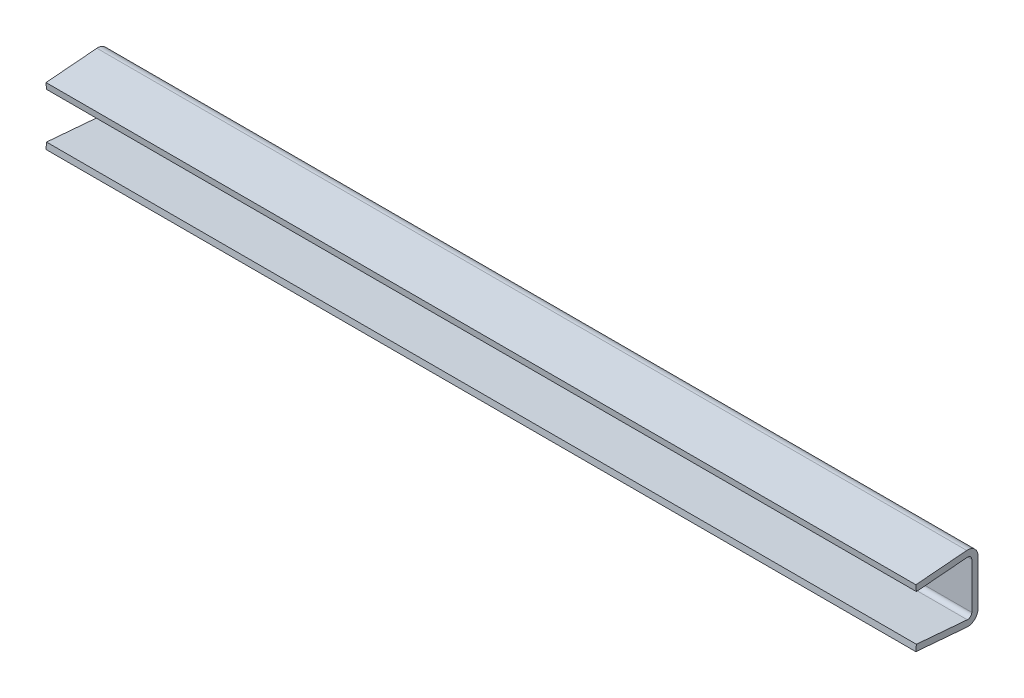
ISO-10303-21;
HEADER;
FILE_DESCRIPTION(('STEP AP214'),'2;1');
FILE_NAME('part.step','',(''),(''),'','','');
FILE_SCHEMA(('AUTOMOTIVE_DESIGN { 1 0 10303 214 1 1 1 1 }'));
ENDSEC;
DATA;
#1=APPLICATION_CONTEXT('core data for automotive mechanical design processes');
#2=APPLICATION_PROTOCOL_DEFINITION('international standard','automotive_design',2000,#1);
#3=PRODUCT_CONTEXT('',#1,'mechanical');
#4=PRODUCT('Part','Part','',(#3));
#5=PRODUCT_RELATED_PRODUCT_CATEGORY('part','',(#4));
#6=PRODUCT_DEFINITION_FORMATION('','',#4);
#7=PRODUCT_DEFINITION_CONTEXT('part definition',#1,'design');
#8=PRODUCT_DEFINITION('design','',#6,#7);
#9=PRODUCT_DEFINITION_SHAPE('','',#8);
#10=(LENGTH_UNIT() NAMED_UNIT(*) SI_UNIT(.MILLI.,.METRE.));
#11=(NAMED_UNIT(*) PLANE_ANGLE_UNIT() SI_UNIT($,.RADIAN.));
#12=(NAMED_UNIT(*) SI_UNIT($,.STERADIAN.) SOLID_ANGLE_UNIT());
#13=UNCERTAINTY_MEASURE_WITH_UNIT(LENGTH_MEASURE(1.E-05),#10,'distance_accuracy_value','');
#14=(GEOMETRIC_REPRESENTATION_CONTEXT(3) GLOBAL_UNCERTAINTY_ASSIGNED_CONTEXT((#13)) GLOBAL_UNIT_ASSIGNED_CONTEXT((#10,
#11,#12)) REPRESENTATION_CONTEXT('',''));
#15=CARTESIAN_POINT('',(0.,0.,0.));
#16=DIRECTION('',(0.,0.,1.));
#17=DIRECTION('',(1.,0.,0.));
#18=AXIS2_PLACEMENT_3D('',#15,#16,#17);
#19=CARTESIAN_POINT('',(-21.,6.15660022588365,-21.));
#20=DIRECTION('',(1.,0.,0.));
#21=DIRECTION('',(0.,1.,0.));
#22=AXIS2_PLACEMENT_3D('',#19,#20,#21);
#23=PLANE('',#22);
#24=DIRECTION('',(0.,-0.0830454798537403,0.99654575824488));
#25=VECTOR('',#24,1.);
#26=CARTESIAN_POINT('',(-21.,6.65487310500609,-20.9584772600731));
#27=LINE('',#26,#25);
#28=CARTESIAN_POINT('',(-21.,6.65487310500609,-20.9584772600731));
#29=VERTEX_POINT('',#28);
#30=CARTESIAN_POINT('',(-21.,6.45,-18.5));
#31=VERTEX_POINT('',#30);
#32=EDGE_CURVE('E189',#29,#31,#27,.T.);
#33=ORIENTED_EDGE('',*,*,#32,.F.);
#34=CARTESIAN_POINT('',(-21.,6.15660022588365,-21.));
#35=DIRECTION('',(1.,0.,0.));
#36=DIRECTION('',(0.,0.,-1.));
#37=AXIS2_PLACEMENT_3D('',#34,#35,#36);
#38=CIRCLE('',#37,0.5);
#39=CARTESIAN_POINT('',(-21.,6.15660022588365,-21.5));
#40=VERTEX_POINT('',#39);
#41=EDGE_CURVE('E27',#40,#29,#38,.T.);
#42=ORIENTED_EDGE('',*,*,#41,.F.);
#43=DIRECTION('',(0.,1.,0.));
#44=VECTOR('',#43,1.);
#45=CARTESIAN_POINT('',(-21.,3.94339977411635,-21.5));
#46=LINE('',#45,#44);
#47=CARTESIAN_POINT('',(-21.,3.94339977411635,-21.5));
#48=VERTEX_POINT('',#47);
#49=EDGE_CURVE('E185',#48,#40,#46,.T.);
#50=ORIENTED_EDGE('',*,*,#49,.F.);
#51=CARTESIAN_POINT('',(-21.,3.94339977411635,-21.));
#52=DIRECTION('',(1.,0.,0.));
#53=DIRECTION('',(0.,0.,1.));
#54=AXIS2_PLACEMENT_3D('',#51,#52,#53);
#55=CIRCLE('',#54,0.5);
#56=CARTESIAN_POINT('',(-21.,3.4451268949939,-20.9584772600731));
#57=VERTEX_POINT('',#56);
#58=EDGE_CURVE('E126',#57,#48,#55,.T.);
#59=ORIENTED_EDGE('',*,*,#58,.F.);
#60=DIRECTION('',(0.,-0.08304547985374,-0.99654575824488));
#61=VECTOR('',#60,1.);
#62=CARTESIAN_POINT('',(-21.,3.65,-18.5));
#63=LINE('',#62,#61);
#64=CARTESIAN_POINT('',(-21.,3.65,-18.5));
#65=VERTEX_POINT('',#64);
#66=EDGE_CURVE('E118',#65,#57,#63,.T.);
#67=ORIENTED_EDGE('',*,*,#66,.F.);
#68=DIRECTION('',(0.,0.99654575824488,-0.0830454798537401));
#69=VECTOR('',#68,1.);
#70=CARTESIAN_POINT('',(-21.,3.65,-18.5));
#71=LINE('',#70,#69);
#72=CARTESIAN_POINT('',(-21.,3.94896372747346,-18.5249136439561));
#73=VERTEX_POINT('',#72);
#74=EDGE_CURVE('E122',#65,#73,#71,.T.);
#75=ORIENTED_EDGE('',*,*,#74,.T.);
#76=DIRECTION('',(0.,-0.08304547985374,-0.99654575824488));
#77=VECTOR('',#76,1.);
#78=CARTESIAN_POINT('',(-21.,3.94896372747346,-18.5249136439561));
#79=LINE('',#78,#77);
#80=CARTESIAN_POINT('',(-21.,3.74409062246737,-20.9833909040292));
#81=VERTEX_POINT('',#80);
#82=EDGE_CURVE('E167',#73,#81,#79,.T.);
#83=ORIENTED_EDGE('',*,*,#82,.T.);
#84=CARTESIAN_POINT('',(-21.,3.94339977411635,-21.));
#85=DIRECTION('',(1.,0.,0.));
#86=DIRECTION('',(0.,0.,-1.));
#87=AXIS2_PLACEMENT_3D('',#84,#85,#86);
#88=CIRCLE('',#87,0.2);
#89=CARTESIAN_POINT('',(-21.,3.94339977411635,-21.2));
#90=VERTEX_POINT('',#89);
#91=EDGE_CURVE('E172',#81,#90,#88,.T.);
#92=ORIENTED_EDGE('',*,*,#91,.T.);
#93=DIRECTION('',(0.,1.,0.));
#94=VECTOR('',#93,1.);
#95=CARTESIAN_POINT('',(-21.,3.94339977411635,-21.2));
#96=LINE('',#95,#94);
#97=CARTESIAN_POINT('',(-21.,6.15660022588365,-21.2));
#98=VERTEX_POINT('',#97);
#99=EDGE_CURVE('E174',#90,#98,#96,.T.);
#100=ORIENTED_EDGE('',*,*,#99,.T.);
#101=CARTESIAN_POINT('',(-21.,6.15660022588365,-21.));
#102=DIRECTION('',(1.,0.,0.));
#103=DIRECTION('',(0.,0.,-1.));
#104=AXIS2_PLACEMENT_3D('',#101,#102,#103);
#105=CIRCLE('',#104,0.2);
#106=CARTESIAN_POINT('',(-21.,6.35590937753263,-20.9833909040292));
#107=VERTEX_POINT('',#106);
#108=EDGE_CURVE('E228',#98,#107,#105,.T.);
#109=ORIENTED_EDGE('',*,*,#108,.T.);
#110=DIRECTION('',(0.,-0.0830454798537403,0.99654575824488));
#111=VECTOR('',#110,1.);
#112=CARTESIAN_POINT('',(-21.,6.35590937753263,-20.9833909040292));
#113=LINE('',#112,#111);
#114=CARTESIAN_POINT('',(-21.,6.15103627252653,-18.5249136439561));
#115=VERTEX_POINT('',#114);
#116=EDGE_CURVE('E159',#107,#115,#113,.T.);
#117=ORIENTED_EDGE('',*,*,#116,.T.);
#118=DIRECTION('',(0.,0.99654575824488,0.0830454798537372));
#119=VECTOR('',#118,1.);
#120=CARTESIAN_POINT('',(-21.,6.15103627252653,-18.5249136439561));
#121=LINE('',#120,#119);
#122=EDGE_CURVE('E161',#115,#31,#121,.T.);
#123=ORIENTED_EDGE('',*,*,#122,.T.);
#124=EDGE_LOOP('',(#33,#42,#50,#59,#67,#75,#83,#92,#100,#109,#117,#123));
#125=FACE_BOUND('',#124,.T.);
#126=ADVANCED_FACE('F16',(#125),#23,.F.);
#127=CARTESIAN_POINT('',(21.,6.15660022588367,-21.));
#128=DIRECTION('',(1.,0.,0.));
#129=DIRECTION('',(0.,1.,0.));
#130=AXIS2_PLACEMENT_3D('',#127,#128,#129);
#131=PLANE('',#130);
#132=DIRECTION('',(0.,-0.0830454798537403,0.99654575824488));
#133=VECTOR('',#132,1.);
#134=CARTESIAN_POINT('',(21.,6.65487310500611,-20.9584772600731));
#135=LINE('',#134,#133);
#136=CARTESIAN_POINT('',(21.,6.65487310500611,-20.9584772600731));
#137=VERTEX_POINT('',#136);
#138=CARTESIAN_POINT('',(21.,6.45,-18.5));
#139=VERTEX_POINT('',#138);
#140=EDGE_CURVE('E200',#137,#139,#135,.T.);
#141=ORIENTED_EDGE('',*,*,#140,.T.);
#142=DIRECTION('',(0.,0.99654575824488,0.0830454798537372));
#143=VECTOR('',#142,1.);
#144=CARTESIAN_POINT('',(21.,6.15103627252655,-18.5249136439561));
#145=LINE('',#144,#143);
#146=CARTESIAN_POINT('',(21.,6.15103627252655,-18.5249136439561));
#147=VERTEX_POINT('',#146);
#148=EDGE_CURVE('E186',#147,#139,#145,.T.);
#149=ORIENTED_EDGE('',*,*,#148,.F.);
#150=DIRECTION('',(0.,-0.0830454798537403,0.99654575824488));
#151=VECTOR('',#150,1.);
#152=CARTESIAN_POINT('',(21.,6.35590937753265,-20.9833909040292));
#153=LINE('',#152,#151);
#154=CARTESIAN_POINT('',(21.,6.35590937753265,-20.9833909040292));
#155=VERTEX_POINT('',#154);
#156=EDGE_CURVE('E237',#155,#147,#153,.T.);
#157=ORIENTED_EDGE('',*,*,#156,.F.);
#158=CARTESIAN_POINT('',(21.,6.15660022588367,-21.));
#159=DIRECTION('',(1.,0.,0.));
#160=DIRECTION('',(0.,0.,-1.));
#161=AXIS2_PLACEMENT_3D('',#158,#159,#160);
#162=CIRCLE('',#161,0.2);
#163=CARTESIAN_POINT('',(21.,6.15660022588367,-21.2));
#164=VERTEX_POINT('',#163);
#165=EDGE_CURVE('E177',#164,#155,#162,.T.);
#166=ORIENTED_EDGE('',*,*,#165,.F.);
#167=DIRECTION('',(0.,1.,0.));
#168=VECTOR('',#167,1.);
#169=CARTESIAN_POINT('',(21.,3.94339977411637,-21.2));
#170=LINE('',#169,#168);
#171=CARTESIAN_POINT('',(21.,3.94339977411637,-21.2));
#172=VERTEX_POINT('',#171);
#173=EDGE_CURVE('E169',#172,#164,#170,.T.);
#174=ORIENTED_EDGE('',*,*,#173,.F.);
#175=CARTESIAN_POINT('',(21.,3.94339977411637,-21.));
#176=DIRECTION('',(1.,0.,0.));
#177=DIRECTION('',(0.,0.,-1.));
#178=AXIS2_PLACEMENT_3D('',#175,#176,#177);
#179=CIRCLE('',#178,0.2);
#180=CARTESIAN_POINT('',(21.,3.74409062246738,-20.9833909040292));
#181=VERTEX_POINT('',#180);
#182=EDGE_CURVE('E164',#181,#172,#179,.T.);
#183=ORIENTED_EDGE('',*,*,#182,.F.);
#184=DIRECTION('',(0.,-0.08304547985374,-0.99654575824488));
#185=VECTOR('',#184,1.);
#186=CARTESIAN_POINT('',(21.,3.94896372747348,-18.5249136439561));
#187=LINE('',#186,#185);
#188=CARTESIAN_POINT('',(21.,3.94896372747348,-18.5249136439561));
#189=VERTEX_POINT('',#188);
#190=EDGE_CURVE('E148',#189,#181,#187,.T.);
#191=ORIENTED_EDGE('',*,*,#190,.F.);
#192=DIRECTION('',(0.,0.99654575824488,-0.0830454798537401));
#193=VECTOR('',#192,1.);
#194=CARTESIAN_POINT('',(21.,3.65,-18.5));
#195=LINE('',#194,#193);
#196=CARTESIAN_POINT('',(21.,3.65,-18.5));
#197=VERTEX_POINT('',#196);
#198=EDGE_CURVE('E132',#197,#189,#195,.T.);
#199=ORIENTED_EDGE('',*,*,#198,.F.);
#200=DIRECTION('',(0.,-0.08304547985374,-0.99654575824488));
#201=VECTOR('',#200,1.);
#202=CARTESIAN_POINT('',(21.,3.65,-18.5));
#203=LINE('',#202,#201);
#204=CARTESIAN_POINT('',(21.,3.44512689499392,-20.9584772600731));
#205=VERTEX_POINT('',#204);
#206=EDGE_CURVE('E138',#197,#205,#203,.T.);
#207=ORIENTED_EDGE('',*,*,#206,.T.);
#208=CARTESIAN_POINT('',(21.,3.94339977411637,-21.));
#209=DIRECTION('',(1.,0.,0.));
#210=DIRECTION('',(0.,0.,1.));
#211=AXIS2_PLACEMENT_3D('',#208,#209,#210);
#212=CIRCLE('',#211,0.5);
#213=CARTESIAN_POINT('',(21.,3.94339977411637,-21.5));
#214=VERTEX_POINT('',#213);
#215=EDGE_CURVE('E181',#205,#214,#212,.T.);
#216=ORIENTED_EDGE('',*,*,#215,.T.);
#217=DIRECTION('',(0.,1.,0.));
#218=VECTOR('',#217,1.);
#219=CARTESIAN_POINT('',(21.,3.94339977411637,-21.5));
#220=LINE('',#219,#218);
#221=CARTESIAN_POINT('',(21.,6.15660022588367,-21.5));
#222=VERTEX_POINT('',#221);
#223=EDGE_CURVE('E224',#214,#222,#220,.T.);
#224=ORIENTED_EDGE('',*,*,#223,.T.);
#225=CARTESIAN_POINT('',(21.,6.15660022588367,-21.));
#226=DIRECTION('',(1.,0.,0.));
#227=DIRECTION('',(0.,0.,-1.));
#228=AXIS2_PLACEMENT_3D('',#225,#226,#227);
#229=CIRCLE('',#228,0.5);
#230=EDGE_CURVE('E11',#222,#137,#229,.T.);
#231=ORIENTED_EDGE('',*,*,#230,.T.);
#232=EDGE_LOOP('',(#141,#149,#157,#166,#174,#183,#191,#199,#207,#216,#224,#231));
#233=FACE_BOUND('',#232,.T.);
#234=ADVANCED_FACE('F272',(#233),#131,.T.);
#235=CARTESIAN_POINT('',(21.,6.15660022588367,-21.));
#236=DIRECTION('',(-1.,0.,0.));
#237=DIRECTION('',(0.,0.,1.));
#238=AXIS2_PLACEMENT_3D('',#235,#236,#237);
#239=CYLINDRICAL_SURFACE('',#238,0.5);
#240=ORIENTED_EDGE('',*,*,#41,.T.);
#241=DIRECTION('',(-1.,0.,0.));
#242=VECTOR('',#241,1.);
#243=CARTESIAN_POINT('',(21.,6.65487310500611,-20.9584772600731));
#244=LINE('',#243,#242);
#245=EDGE_CURVE('E163',#137,#29,#244,.T.);
#246=ORIENTED_EDGE('',*,*,#245,.F.);
#247=ORIENTED_EDGE('',*,*,#230,.F.);
#248=DIRECTION('',(-1.,0.,0.));
#249=VECTOR('',#248,1.);
#250=CARTESIAN_POINT('',(21.,6.15660022588367,-21.5));
#251=LINE('',#250,#249);
#252=EDGE_CURVE('E199',#222,#40,#251,.T.);
#253=ORIENTED_EDGE('',*,*,#252,.T.);
#254=EDGE_LOOP('',(#240,#246,#247,#253));
#255=FACE_BOUND('',#254,.T.);
#256=ADVANCED_FACE('F256',(#255),#239,.T.);
#257=CARTESIAN_POINT('',(21.,3.94339977411637,-21.5));
#258=DIRECTION('',(0.,0.,1.));
#259=DIRECTION('',(0.,-1.,0.));
#260=AXIS2_PLACEMENT_3D('',#257,#258,#259);
#261=PLANE('',#260);
#262=ORIENTED_EDGE('',*,*,#49,.T.);
#263=ORIENTED_EDGE('',*,*,#252,.F.);
#264=ORIENTED_EDGE('',*,*,#223,.F.);
#265=DIRECTION('',(-1.,0.,0.));
#266=VECTOR('',#265,1.);
#267=CARTESIAN_POINT('',(21.,3.94339977411637,-21.5));
#268=LINE('',#267,#266);
#269=EDGE_CURVE('E180',#214,#48,#268,.T.);
#270=ORIENTED_EDGE('',*,*,#269,.T.);
#271=EDGE_LOOP('',(#262,#263,#264,#270));
#272=FACE_BOUND('',#271,.T.);
#273=ADVANCED_FACE('F423',(#272),#261,.F.);
#274=CARTESIAN_POINT('',(21.,3.94339977411637,-21.));
#275=DIRECTION('',(-1.,0.,0.));
#276=DIRECTION('',(0.,0.,1.));
#277=AXIS2_PLACEMENT_3D('',#274,#275,#276);
#278=CYLINDRICAL_SURFACE('',#277,0.5);
#279=ORIENTED_EDGE('',*,*,#58,.T.);
#280=ORIENTED_EDGE('',*,*,#269,.F.);
#281=ORIENTED_EDGE('',*,*,#215,.F.);
#282=DIRECTION('',(-1.,0.,0.));
#283=VECTOR('',#282,1.);
#284=CARTESIAN_POINT('',(21.,3.44512689499392,-20.9584772600731));
#285=LINE('',#284,#283);
#286=EDGE_CURVE('E131',#205,#57,#285,.T.);
#287=ORIENTED_EDGE('',*,*,#286,.T.);
#288=EDGE_LOOP('',(#279,#280,#281,#287));
#289=FACE_BOUND('',#288,.T.);
#290=ADVANCED_FACE('F446',(#289),#278,.T.);
#291=CARTESIAN_POINT('',(21.,3.65,-18.5));
#292=DIRECTION('',(0.,0.99654575824488,-0.08304547985374));
#293=DIRECTION('',(-1.,0.,0.));
#294=AXIS2_PLACEMENT_3D('',#291,#292,#293);
#295=PLANE('',#294);
#296=ORIENTED_EDGE('',*,*,#66,.T.);
#297=ORIENTED_EDGE('',*,*,#286,.F.);
#298=ORIENTED_EDGE('',*,*,#206,.F.);
#299=DIRECTION('',(-1.,0.,0.));
#300=VECTOR('',#299,1.);
#301=CARTESIAN_POINT('',(21.,3.65,-18.5));
#302=LINE('',#301,#300);
#303=EDGE_CURVE('E135',#197,#65,#302,.T.);
#304=ORIENTED_EDGE('',*,*,#303,.T.);
#305=EDGE_LOOP('',(#296,#297,#298,#304));
#306=FACE_BOUND('',#305,.T.);
#307=ADVANCED_FACE('F136',(#306),#295,.F.);
#308=CARTESIAN_POINT('',(21.,3.65,-18.5));
#309=DIRECTION('',(0.,0.0830454798537401,0.99654575824488));
#310=DIRECTION('',(1.,0.,0.));
#311=AXIS2_PLACEMENT_3D('',#308,#309,#310);
#312=PLANE('',#311);
#313=ORIENTED_EDGE('',*,*,#74,.F.);
#314=ORIENTED_EDGE('',*,*,#303,.F.);
#315=ORIENTED_EDGE('',*,*,#198,.T.);
#316=DIRECTION('',(-1.,0.,0.));
#317=VECTOR('',#316,1.);
#318=CARTESIAN_POINT('',(21.,3.94896372747348,-18.5249136439561));
#319=LINE('',#318,#317);
#320=EDGE_CURVE('E145',#189,#73,#319,.T.);
#321=ORIENTED_EDGE('',*,*,#320,.T.);
#322=EDGE_LOOP('',(#313,#314,#315,#321));
#323=FACE_BOUND('',#322,.T.);
#324=ADVANCED_FACE('F143',(#323),#312,.T.);
#325=CARTESIAN_POINT('',(21.,3.94896372747348,-18.5249136439561));
#326=DIRECTION('',(0.,0.99654575824488,-0.08304547985374));
#327=DIRECTION('',(-1.,0.,0.));
#328=AXIS2_PLACEMENT_3D('',#325,#326,#327);
#329=PLANE('',#328);
#330=ORIENTED_EDGE('',*,*,#82,.F.);
#331=ORIENTED_EDGE('',*,*,#320,.F.);
#332=ORIENTED_EDGE('',*,*,#190,.T.);
#333=DIRECTION('',(-1.,0.,0.));
#334=VECTOR('',#333,1.);
#335=CARTESIAN_POINT('',(21.,3.74409062246738,-20.9833909040292));
#336=LINE('',#335,#334);
#337=EDGE_CURVE('E168',#181,#81,#336,.T.);
#338=ORIENTED_EDGE('',*,*,#337,.T.);
#339=EDGE_LOOP('',(#330,#331,#332,#338));
#340=FACE_BOUND('',#339,.T.);
#341=ADVANCED_FACE('F385',(#340),#329,.T.);
#342=CARTESIAN_POINT('',(21.,3.94339977411637,-21.));
#343=DIRECTION('',(-1.,0.,0.));
#344=DIRECTION('',(0.,0.,1.));
#345=AXIS2_PLACEMENT_3D('',#342,#343,#344);
#346=CYLINDRICAL_SURFACE('',#345,0.2);
#347=ORIENTED_EDGE('',*,*,#91,.F.);
#348=ORIENTED_EDGE('',*,*,#337,.F.);
#349=ORIENTED_EDGE('',*,*,#182,.T.);
#350=DIRECTION('',(-1.,0.,0.));
#351=VECTOR('',#350,1.);
#352=CARTESIAN_POINT('',(21.,3.94339977411637,-21.2));
#353=LINE('',#352,#351);
#354=EDGE_CURVE('E173',#172,#90,#353,.T.);
#355=ORIENTED_EDGE('',*,*,#354,.T.);
#356=EDGE_LOOP('',(#347,#348,#349,#355));
#357=FACE_BOUND('',#356,.T.);
#358=ADVANCED_FACE('F401',(#357),#346,.F.);
#359=CARTESIAN_POINT('',(21.,3.94339977411637,-21.2));
#360=DIRECTION('',(0.,0.,1.));
#361=DIRECTION('',(0.,-1.,0.));
#362=AXIS2_PLACEMENT_3D('',#359,#360,#361);
#363=PLANE('',#362);
#364=ORIENTED_EDGE('',*,*,#99,.F.);
#365=ORIENTED_EDGE('',*,*,#354,.F.);
#366=ORIENTED_EDGE('',*,*,#173,.T.);
#367=DIRECTION('',(-1.,0.,0.));
#368=VECTOR('',#367,1.);
#369=CARTESIAN_POINT('',(21.,6.15660022588367,-21.2));
#370=LINE('',#369,#368);
#371=EDGE_CURVE('E206',#164,#98,#370,.T.);
#372=ORIENTED_EDGE('',*,*,#371,.T.);
#373=EDGE_LOOP('',(#364,#365,#366,#372));
#374=FACE_BOUND('',#373,.T.);
#375=ADVANCED_FACE('F397',(#374),#363,.T.);
#376=CARTESIAN_POINT('',(21.,6.15660022588367,-21.));
#377=DIRECTION('',(-1.,0.,0.));
#378=DIRECTION('',(0.,0.,1.));
#379=AXIS2_PLACEMENT_3D('',#376,#377,#378);
#380=CYLINDRICAL_SURFACE('',#379,0.2);
#381=ORIENTED_EDGE('',*,*,#108,.F.);
#382=ORIENTED_EDGE('',*,*,#371,.F.);
#383=ORIENTED_EDGE('',*,*,#165,.T.);
#384=DIRECTION('',(-1.,0.,0.));
#385=VECTOR('',#384,1.);
#386=CARTESIAN_POINT('',(21.,6.35590937753265,-20.9833909040292));
#387=LINE('',#386,#385);
#388=EDGE_CURVE('E246',#155,#107,#387,.T.);
#389=ORIENTED_EDGE('',*,*,#388,.T.);
#390=EDGE_LOOP('',(#381,#382,#383,#389));
#391=FACE_BOUND('',#390,.T.);
#392=ADVANCED_FACE('F18',(#391),#380,.F.);
#393=CARTESIAN_POINT('',(21.,6.35590937753265,-20.9833909040292));
#394=DIRECTION('',(0.,-0.99654575824488,-0.0830454798537403));
#395=DIRECTION('',(0.,0.0830454798537403,-0.99654575824488));
#396=AXIS2_PLACEMENT_3D('',#393,#394,#395);
#397=PLANE('',#396);
#398=ORIENTED_EDGE('',*,*,#116,.F.);
#399=ORIENTED_EDGE('',*,*,#388,.F.);
#400=ORIENTED_EDGE('',*,*,#156,.T.);
#401=DIRECTION('',(-1.,0.,0.));
#402=VECTOR('',#401,1.);
#403=CARTESIAN_POINT('',(21.,6.15103627252655,-18.5249136439561));
#404=LINE('',#403,#402);
#405=EDGE_CURVE('E20',#147,#115,#404,.T.);
#406=ORIENTED_EDGE('',*,*,#405,.T.);
#407=EDGE_LOOP('',(#398,#399,#400,#406));
#408=FACE_BOUND('',#407,.T.);
#409=ADVANCED_FACE('F287',(#408),#397,.T.);
#410=CARTESIAN_POINT('',(21.,6.15103627252655,-18.5249136439561));
#411=DIRECTION('',(0.,-0.0830454798537372,0.99654575824488));
#412=DIRECTION('',(-1.,0.,0.));
#413=AXIS2_PLACEMENT_3D('',#410,#411,#412);
#414=PLANE('',#413);
#415=ORIENTED_EDGE('',*,*,#122,.F.);
#416=ORIENTED_EDGE('',*,*,#405,.F.);
#417=ORIENTED_EDGE('',*,*,#148,.T.);
#418=DIRECTION('',(-1.,0.,0.));
#419=VECTOR('',#418,1.);
#420=CARTESIAN_POINT('',(21.,6.45,-18.5));
#421=LINE('',#420,#419);
#422=EDGE_CURVE('E193',#139,#31,#421,.T.);
#423=ORIENTED_EDGE('',*,*,#422,.T.);
#424=EDGE_LOOP('',(#415,#416,#417,#423));
#425=FACE_BOUND('',#424,.T.);
#426=ADVANCED_FACE('F268',(#425),#414,.T.);
#427=CARTESIAN_POINT('',(21.,6.65487310500611,-20.9584772600731));
#428=DIRECTION('',(0.,-0.99654575824488,-0.0830454798537403));
#429=DIRECTION('',(0.,0.0830454798537403,-0.99654575824488));
#430=AXIS2_PLACEMENT_3D('',#427,#428,#429);
#431=PLANE('',#430);
#432=ORIENTED_EDGE('',*,*,#32,.T.);
#433=ORIENTED_EDGE('',*,*,#422,.F.);
#434=ORIENTED_EDGE('',*,*,#140,.F.);
#435=ORIENTED_EDGE('',*,*,#245,.T.);
#436=EDGE_LOOP('',(#432,#433,#434,#435));
#437=FACE_BOUND('',#436,.T.);
#438=ADVANCED_FACE('F260',(#437),#431,.F.);
#439=CLOSED_SHELL('',(#126,#234,#256,#273,#290,#307,#324,#341,#358,#375,#392,#409,#426,#438));
#440=MANIFOLD_SOLID_BREP('B1',#439);
#441=ADVANCED_BREP_SHAPE_REPRESENTATION('',(#18,#440),#14);
#442=SHAPE_DEFINITION_REPRESENTATION(#9,#441);
ENDSEC;
END-ISO-10303-21;
